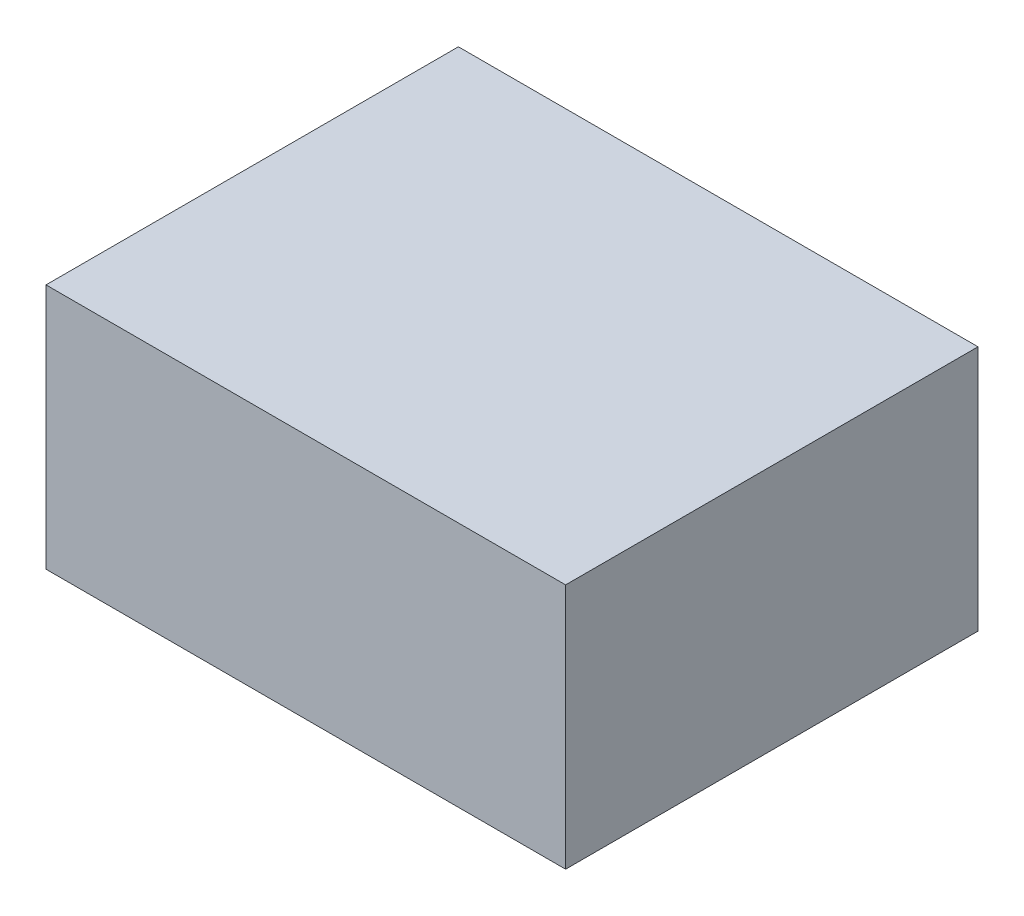
ISO-10303-21;
HEADER;
FILE_DESCRIPTION(('STEP AP214'),'2;1');
FILE_NAME('part.step','',(''),(''),'','','');
FILE_SCHEMA(('AUTOMOTIVE_DESIGN { 1 0 10303 214 1 1 1 1 }'));
ENDSEC;
DATA;
#1=APPLICATION_CONTEXT('core data for automotive mechanical design processes');
#2=APPLICATION_PROTOCOL_DEFINITION('international standard','automotive_design',2000,#1);
#3=PRODUCT_CONTEXT('',#1,'mechanical');
#4=PRODUCT('Part','Part','',(#3));
#5=PRODUCT_RELATED_PRODUCT_CATEGORY('part','',(#4));
#6=PRODUCT_DEFINITION_FORMATION('','',#4);
#7=PRODUCT_DEFINITION_CONTEXT('part definition',#1,'design');
#8=PRODUCT_DEFINITION('design','',#6,#7);
#9=PRODUCT_DEFINITION_SHAPE('','',#8);
#10=(LENGTH_UNIT() NAMED_UNIT(*) SI_UNIT(.MILLI.,.METRE.));
#11=(NAMED_UNIT(*) PLANE_ANGLE_UNIT() SI_UNIT($,.RADIAN.));
#12=(NAMED_UNIT(*) SI_UNIT($,.STERADIAN.) SOLID_ANGLE_UNIT());
#13=UNCERTAINTY_MEASURE_WITH_UNIT(LENGTH_MEASURE(1.E-05),#10,'distance_accuracy_value','');
#14=(GEOMETRIC_REPRESENTATION_CONTEXT(3) GLOBAL_UNCERTAINTY_ASSIGNED_CONTEXT((#13)) GLOBAL_UNIT_ASSIGNED_CONTEXT((#10,
#11,#12)) REPRESENTATION_CONTEXT('',''));
#15=CARTESIAN_POINT('',(0.,0.,0.));
#16=DIRECTION('',(0.,0.,1.));
#17=DIRECTION('',(1.,0.,0.));
#18=AXIS2_PLACEMENT_3D('',#15,#16,#17);
#19=CARTESIAN_POINT('',(0.,20.9,0.));
#20=DIRECTION('',(0.,-1.,0.));
#21=DIRECTION('',(0.,0.,-1.));
#22=AXIS2_PLACEMENT_3D('',#19,#20,#21);
#23=PLANE('',#22);
#24=DIRECTION('',(0.,0.,1.));
#25=VECTOR('',#24,1.);
#26=CARTESIAN_POINT('',(-22.05,20.9,-17.5));
#27=LINE('',#26,#25);
#28=CARTESIAN_POINT('',(-22.05,20.9,-17.5));
#29=VERTEX_POINT('',#28);
#30=CARTESIAN_POINT('',(-22.05,20.9,17.5));
#31=VERTEX_POINT('',#30);
#32=EDGE_CURVE('E84',#29,#31,#27,.T.);
#33=ORIENTED_EDGE('',*,*,#32,.T.);
#34=DIRECTION('',(1.,0.,0.));
#35=VECTOR('',#34,1.);
#36=CARTESIAN_POINT('',(22.05,20.9,17.5));
#37=LINE('',#36,#35);
#38=CARTESIAN_POINT('',(22.05,20.9,17.5));
#39=VERTEX_POINT('',#38);
#40=EDGE_CURVE('E80',#31,#39,#37,.T.);
#41=ORIENTED_EDGE('',*,*,#40,.T.);
#42=DIRECTION('',(0.,0.,-1.));
#43=VECTOR('',#42,1.);
#44=CARTESIAN_POINT('',(22.05,20.9,-17.5));
#45=LINE('',#44,#43);
#46=CARTESIAN_POINT('',(22.05,20.9,-17.5));
#47=VERTEX_POINT('',#46);
#48=EDGE_CURVE('E82',#39,#47,#45,.T.);
#49=ORIENTED_EDGE('',*,*,#48,.T.);
#50=DIRECTION('',(-1.,0.,0.));
#51=VECTOR('',#50,1.);
#52=CARTESIAN_POINT('',(22.05,20.9,-17.5));
#53=LINE('',#52,#51);
#54=EDGE_CURVE('E50',#47,#29,#53,.T.);
#55=ORIENTED_EDGE('',*,*,#54,.T.);
#56=EDGE_LOOP('',(#33,#41,#49,#55));
#57=FACE_BOUND('',#56,.T.);
#58=ADVANCED_FACE('F33',(#57),#23,.F.);
#59=CARTESIAN_POINT('',(-22.05,20.9,-17.5));
#60=DIRECTION('',(1.,0.,0.));
#61=DIRECTION('',(0.,0.,-1.));
#62=AXIS2_PLACEMENT_3D('',#59,#60,#61);
#63=PLANE('',#62);
#64=DIRECTION('',(0.,0.,1.));
#65=VECTOR('',#64,1.);
#66=CARTESIAN_POINT('',(-22.05,0.,-17.5));
#67=LINE('',#66,#65);
#68=CARTESIAN_POINT('',(-22.05,0.,-17.5));
#69=VERTEX_POINT('',#68);
#70=CARTESIAN_POINT('',(-22.05,0.,17.5));
#71=VERTEX_POINT('',#70);
#72=EDGE_CURVE('E96',#69,#71,#67,.T.);
#73=ORIENTED_EDGE('',*,*,#72,.T.);
#74=DIRECTION('',(0.,-1.,0.));
#75=VECTOR('',#74,1.);
#76=CARTESIAN_POINT('',(-22.05,20.9,17.5));
#77=LINE('',#76,#75);
#78=EDGE_CURVE('E11',#31,#71,#77,.T.);
#79=ORIENTED_EDGE('',*,*,#78,.F.);
#80=ORIENTED_EDGE('',*,*,#32,.F.);
#81=DIRECTION('',(0.,-1.,0.));
#82=VECTOR('',#81,1.);
#83=CARTESIAN_POINT('',(-22.05,20.9,-17.5));
#84=LINE('',#83,#82);
#85=EDGE_CURVE('E92',#29,#69,#84,.T.);
#86=ORIENTED_EDGE('',*,*,#85,.T.);
#87=EDGE_LOOP('',(#73,#79,#80,#86));
#88=FACE_BOUND('',#87,.T.);
#89=ADVANCED_FACE('F35',(#88),#63,.F.);
#90=CARTESIAN_POINT('',(22.05,20.9,17.5));
#91=DIRECTION('',(0.,0.,-1.));
#92=DIRECTION('',(-1.,0.,0.));
#93=AXIS2_PLACEMENT_3D('',#90,#91,#92);
#94=PLANE('',#93);
#95=DIRECTION('',(1.,0.,0.));
#96=VECTOR('',#95,1.);
#97=CARTESIAN_POINT('',(22.05,0.,17.5));
#98=LINE('',#97,#96);
#99=CARTESIAN_POINT('',(22.05,0.,17.5));
#100=VERTEX_POINT('',#99);
#101=EDGE_CURVE('E88',#71,#100,#98,.T.);
#102=ORIENTED_EDGE('',*,*,#101,.T.);
#103=DIRECTION('',(0.,-1.,0.));
#104=VECTOR('',#103,1.);
#105=CARTESIAN_POINT('',(22.05,20.9,17.5));
#106=LINE('',#105,#104);
#107=EDGE_CURVE('E42',#39,#100,#106,.T.);
#108=ORIENTED_EDGE('',*,*,#107,.F.);
#109=ORIENTED_EDGE('',*,*,#40,.F.);
#110=ORIENTED_EDGE('',*,*,#78,.T.);
#111=EDGE_LOOP('',(#102,#108,#109,#110));
#112=FACE_BOUND('',#111,.T.);
#113=ADVANCED_FACE('F87',(#112),#94,.F.);
#114=CARTESIAN_POINT('',(22.05,20.9,-17.5));
#115=DIRECTION('',(-1.,0.,0.));
#116=DIRECTION('',(0.,0.,1.));
#117=AXIS2_PLACEMENT_3D('',#114,#115,#116);
#118=PLANE('',#117);
#119=DIRECTION('',(0.,0.,-1.));
#120=VECTOR('',#119,1.);
#121=CARTESIAN_POINT('',(22.05,0.,-17.5));
#122=LINE('',#121,#120);
#123=CARTESIAN_POINT('',(22.05,0.,-17.5));
#124=VERTEX_POINT('',#123);
#125=EDGE_CURVE('E67',#100,#124,#122,.T.);
#126=ORIENTED_EDGE('',*,*,#125,.T.);
#127=DIRECTION('',(0.,-1.,0.));
#128=VECTOR('',#127,1.);
#129=CARTESIAN_POINT('',(22.05,20.9,-17.5));
#130=LINE('',#129,#128);
#131=EDGE_CURVE('E89',#47,#124,#130,.T.);
#132=ORIENTED_EDGE('',*,*,#131,.F.);
#133=ORIENTED_EDGE('',*,*,#48,.F.);
#134=ORIENTED_EDGE('',*,*,#107,.T.);
#135=EDGE_LOOP('',(#126,#132,#133,#134));
#136=FACE_BOUND('',#135,.T.);
#137=ADVANCED_FACE('F90',(#136),#118,.F.);
#138=CARTESIAN_POINT('',(22.05,20.9,-17.5));
#139=DIRECTION('',(0.,0.,1.));
#140=DIRECTION('',(1.,0.,0.));
#141=AXIS2_PLACEMENT_3D('',#138,#139,#140);
#142=PLANE('',#141);
#143=DIRECTION('',(-1.,0.,0.));
#144=VECTOR('',#143,1.);
#145=CARTESIAN_POINT('',(22.05,0.,-17.5));
#146=LINE('',#145,#144);
#147=EDGE_CURVE('E73',#124,#69,#146,.T.);
#148=ORIENTED_EDGE('',*,*,#147,.T.);
#149=ORIENTED_EDGE('',*,*,#85,.F.);
#150=ORIENTED_EDGE('',*,*,#54,.F.);
#151=ORIENTED_EDGE('',*,*,#131,.T.);
#152=EDGE_LOOP('',(#148,#149,#150,#151));
#153=FACE_BOUND('',#152,.T.);
#154=ADVANCED_FACE('F103',(#153),#142,.F.);
#155=CARTESIAN_POINT('',(0.,0.,0.));
#156=DIRECTION('',(0.,-1.,0.));
#157=DIRECTION('',(0.,0.,-1.));
#158=AXIS2_PLACEMENT_3D('',#155,#156,#157);
#159=PLANE('',#158);
#160=ORIENTED_EDGE('',*,*,#72,.F.);
#161=ORIENTED_EDGE('',*,*,#147,.F.);
#162=ORIENTED_EDGE('',*,*,#125,.F.);
#163=ORIENTED_EDGE('',*,*,#101,.F.);
#164=EDGE_LOOP('',(#160,#161,#162,#163));
#165=FACE_BOUND('',#164,.T.);
#166=ADVANCED_FACE('F106',(#165),#159,.T.);
#167=CLOSED_SHELL('',(#58,#89,#113,#137,#154,#166));
#168=MANIFOLD_SOLID_BREP('B2',#167);
#169=ADVANCED_BREP_SHAPE_REPRESENTATION('',(#18,#168),#14);
#170=SHAPE_DEFINITION_REPRESENTATION(#9,#169);
ENDSEC;
END-ISO-10303-21;
